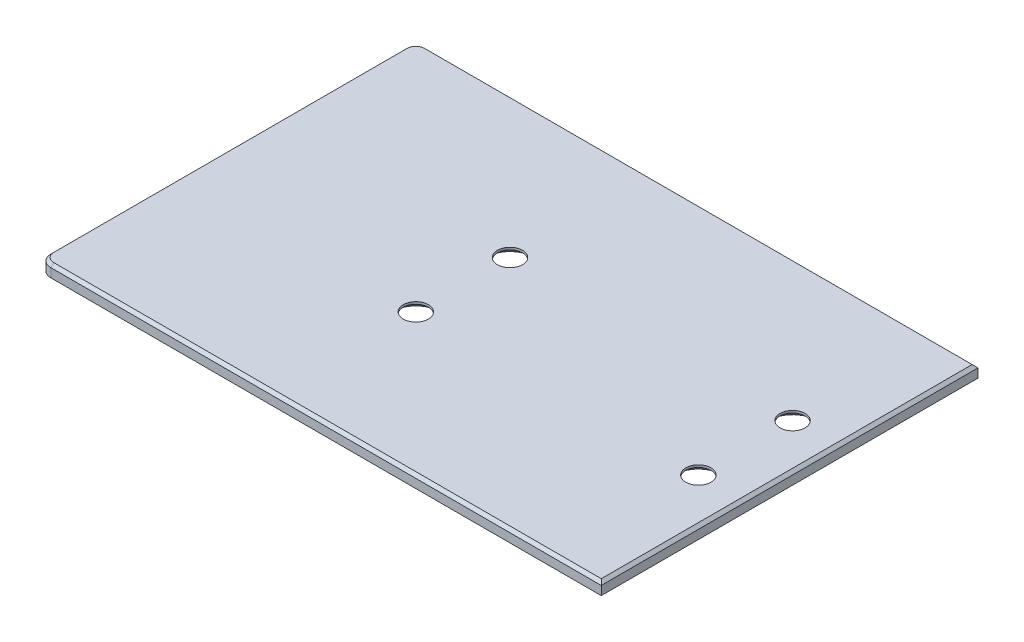
ISO-10303-21;
HEADER;
FILE_DESCRIPTION(('STEP AP214'),'2;1');
FILE_NAME('part.step','',(''),(''),'','','');
FILE_SCHEMA(('AUTOMOTIVE_DESIGN { 1 0 10303 214 1 1 1 1 }'));
ENDSEC;
DATA;
#1=APPLICATION_CONTEXT('core data for automotive mechanical design processes');
#2=APPLICATION_PROTOCOL_DEFINITION('international standard','automotive_design',2000,#1);
#3=PRODUCT_CONTEXT('',#1,'mechanical');
#4=PRODUCT('Part','Part','',(#3));
#5=PRODUCT_RELATED_PRODUCT_CATEGORY('part','',(#4));
#6=PRODUCT_DEFINITION_FORMATION('','',#4);
#7=PRODUCT_DEFINITION_CONTEXT('part definition',#1,'design');
#8=PRODUCT_DEFINITION('design','',#6,#7);
#9=PRODUCT_DEFINITION_SHAPE('','',#8);
#10=(LENGTH_UNIT() NAMED_UNIT(*) SI_UNIT(.MILLI.,.METRE.));
#11=(NAMED_UNIT(*) PLANE_ANGLE_UNIT() SI_UNIT($,.RADIAN.));
#12=(NAMED_UNIT(*) SI_UNIT($,.STERADIAN.) SOLID_ANGLE_UNIT());
#13=UNCERTAINTY_MEASURE_WITH_UNIT(LENGTH_MEASURE(1.E-05),#10,'distance_accuracy_value','');
#14=(GEOMETRIC_REPRESENTATION_CONTEXT(3) GLOBAL_UNCERTAINTY_ASSIGNED_CONTEXT((#13)) GLOBAL_UNIT_ASSIGNED_CONTEXT((#10,
#11,#12)) REPRESENTATION_CONTEXT('',''));
#15=CARTESIAN_POINT('',(0.,0.,0.));
#16=DIRECTION('',(0.,0.,1.));
#17=DIRECTION('',(1.,0.,0.));
#18=AXIS2_PLACEMENT_3D('',#15,#16,#17);
#19=CARTESIAN_POINT('',(0.,0.,-101.6));
#20=DIRECTION('',(-1.,0.,0.));
#21=DIRECTION('',(0.,0.,1.));
#22=AXIS2_PLACEMENT_3D('',#19,#20,#21);
#23=PLANE('',#22);
#24=DIRECTION('',(0.,-1.,0.));
#25=VECTOR('',#24,1.);
#26=CARTESIAN_POINT('',(0.,0.,-3.175));
#27=LINE('',#26,#25);
#28=CARTESIAN_POINT('',(0.,-0.787399999999994,-3.175));
#29=VERTEX_POINT('',#28);
#30=CARTESIAN_POINT('',(0.,-3.175,-3.175));
#31=VERTEX_POINT('',#30);
#32=EDGE_CURVE('E117',#29,#31,#27,.T.);
#33=ORIENTED_EDGE('',*,*,#32,.F.);
#34=DIRECTION('',(0.,0.,-1.));
#35=VECTOR('',#34,1.);
#36=CARTESIAN_POINT('',(0.,-0.787399999999994,-101.6));
#37=LINE('',#36,#35);
#38=CARTESIAN_POINT('',(0.,-0.787399999999994,-98.425));
#39=VERTEX_POINT('',#38);
#40=EDGE_CURVE('E164',#29,#39,#37,.T.);
#41=ORIENTED_EDGE('',*,*,#40,.T.);
#42=DIRECTION('',(0.,-1.,0.));
#43=VECTOR('',#42,1.);
#44=CARTESIAN_POINT('',(0.,0.,-98.425));
#45=LINE('',#44,#43);
#46=CARTESIAN_POINT('',(0.,-3.175,-98.425));
#47=VERTEX_POINT('',#46);
#48=EDGE_CURVE('E139',#39,#47,#45,.T.);
#49=ORIENTED_EDGE('',*,*,#48,.T.);
#50=DIRECTION('',(0.,0.,1.));
#51=VECTOR('',#50,1.);
#52=CARTESIAN_POINT('',(0.,-3.175,-101.6));
#53=LINE('',#52,#51);
#54=EDGE_CURVE('E136',#47,#31,#53,.T.);
#55=ORIENTED_EDGE('',*,*,#54,.T.);
#56=EDGE_LOOP('',(#33,#41,#49,#55));
#57=FACE_BOUND('',#56,.T.);
#58=ADVANCED_FACE('F42',(#57),#23,.T.);
#59=CARTESIAN_POINT('',(0.,0.,-101.6));
#60=DIRECTION('',(0.,1.,0.));
#61=DIRECTION('',(0.,0.,1.));
#62=AXIS2_PLACEMENT_3D('',#59,#60,#61);
#63=PLANE('',#62);
#64=CARTESIAN_POINT('',(3.175,0.,-98.425));
#65=DIRECTION('',(0.,1.,0.));
#66=DIRECTION('',(0.,0.,1.));
#67=AXIS2_PLACEMENT_3D('',#64,#65,#66);
#68=CIRCLE('',#67,2.3876);
#69=CARTESIAN_POINT('',(3.175,0.,-100.8126));
#70=VERTEX_POINT('',#69);
#71=CARTESIAN_POINT('',(0.787399999999995,0.,-98.425));
#72=VERTEX_POINT('',#71);
#73=EDGE_CURVE('E159',#70,#72,#68,.T.);
#74=ORIENTED_EDGE('',*,*,#73,.T.);
#75=DIRECTION('',(0.,0.,1.));
#76=VECTOR('',#75,1.);
#77=CARTESIAN_POINT('',(0.787399999999994,0.,-101.6));
#78=LINE('',#77,#76);
#79=CARTESIAN_POINT('',(0.787399999999994,0.,-3.175));
#80=VERTEX_POINT('',#79);
#81=EDGE_CURVE('E161',#72,#80,#78,.T.);
#82=ORIENTED_EDGE('',*,*,#81,.T.);
#83=CARTESIAN_POINT('',(3.175,0.,-3.175));
#84=DIRECTION('',(0.,1.,0.));
#85=DIRECTION('',(0.,0.,1.));
#86=AXIS2_PLACEMENT_3D('',#83,#84,#85);
#87=CIRCLE('',#86,2.38760000000001);
#88=CARTESIAN_POINT('',(3.175,0.,-0.787399999999994));
#89=VERTEX_POINT('',#88);
#90=EDGE_CURVE('E157',#80,#89,#87,.T.);
#91=ORIENTED_EDGE('',*,*,#90,.T.);
#92=DIRECTION('',(1.,0.,0.));
#93=VECTOR('',#92,1.);
#94=CARTESIAN_POINT('',(0.,0.,-0.787399999999994));
#95=LINE('',#94,#93);
#96=CARTESIAN_POINT('',(150.81885,0.,-0.787399999999994));
#97=VERTEX_POINT('',#96);
#98=EDGE_CURVE('E146',#89,#97,#95,.T.);
#99=ORIENTED_EDGE('',*,*,#98,.T.);
#100=DIRECTION('',(0.,0.,-1.));
#101=VECTOR('',#100,1.);
#102=CARTESIAN_POINT('',(150.81885,0.,-101.6));
#103=LINE('',#102,#101);
#104=CARTESIAN_POINT('',(150.81885,0.,-100.8126));
#105=VERTEX_POINT('',#104);
#106=EDGE_CURVE('E153',#97,#105,#103,.T.);
#107=ORIENTED_EDGE('',*,*,#106,.T.);
#108=DIRECTION('',(-1.,0.,0.));
#109=VECTOR('',#108,1.);
#110=CARTESIAN_POINT('',(3.175,0.,-100.8126));
#111=LINE('',#110,#109);
#112=EDGE_CURVE('E155',#105,#70,#111,.T.);
#113=ORIENTED_EDGE('',*,*,#112,.T.);
#114=EDGE_LOOP('',(#74,#82,#91,#99,#107,#113));
#115=FACE_BOUND('',#114,.T.);
#116=CARTESIAN_POINT('',(63.5,0.,-38.1));
#117=DIRECTION('',(0.,-1.,0.));
#118=DIRECTION('',(0.,0.,-1.));
#119=AXIS2_PLACEMENT_3D('',#116,#117,#118);
#120=CIRCLE('',#119,3.3782);
#121=CARTESIAN_POINT('',(63.5,0.,-41.4782));
#122=VERTEX_POINT('',#121);
#123=EDGE_CURVE('E203',#122,#122,#120,.T.);
#124=ORIENTED_EDGE('',*,*,#123,.T.);
#125=EDGE_LOOP('',(#124));
#126=FACE_BOUND('',#125,.T.);
#127=CARTESIAN_POINT('',(63.5,0.,-63.5));
#128=DIRECTION('',(0.,-1.,0.));
#129=DIRECTION('',(0.,0.,-1.));
#130=AXIS2_PLACEMENT_3D('',#127,#128,#129);
#131=CIRCLE('',#130,3.3782);
#132=CARTESIAN_POINT('',(63.5,0.,-66.8782));
#133=VERTEX_POINT('',#132);
#134=EDGE_CURVE('E212',#133,#133,#131,.T.);
#135=ORIENTED_EDGE('',*,*,#134,.T.);
#136=EDGE_LOOP('',(#135));
#137=FACE_BOUND('',#136,.T.);
#138=CARTESIAN_POINT('',(139.7,0.,-63.5));
#139=DIRECTION('',(0.,-1.,0.));
#140=DIRECTION('',(0.,0.,-1.));
#141=AXIS2_PLACEMENT_3D('',#138,#139,#140);
#142=CIRCLE('',#141,3.3782);
#143=CARTESIAN_POINT('',(139.7,0.,-66.8782));
#144=VERTEX_POINT('',#143);
#145=EDGE_CURVE('E221',#144,#144,#142,.T.);
#146=ORIENTED_EDGE('',*,*,#145,.T.);
#147=EDGE_LOOP('',(#146));
#148=FACE_BOUND('',#147,.T.);
#149=CARTESIAN_POINT('',(139.7,0.,-38.1));
#150=DIRECTION('',(0.,-1.,0.));
#151=DIRECTION('',(0.,0.,-1.));
#152=AXIS2_PLACEMENT_3D('',#149,#150,#151);
#153=CIRCLE('',#152,3.3782);
#154=CARTESIAN_POINT('',(139.7,0.,-41.4782));
#155=VERTEX_POINT('',#154);
#156=EDGE_CURVE('E230',#155,#155,#153,.T.);
#157=ORIENTED_EDGE('',*,*,#156,.T.);
#158=EDGE_LOOP('',(#157));
#159=FACE_BOUND('',#158,.T.);
#160=ADVANCED_FACE('F260',(#115,#126,#137,#148,#159),#63,.T.);
#161=CARTESIAN_POINT('',(0.,-3.175,-101.6));
#162=DIRECTION('',(0.,-1.,0.));
#163=DIRECTION('',(0.,0.,-1.));
#164=AXIS2_PLACEMENT_3D('',#161,#162,#163);
#165=PLANE('',#164);
#166=CARTESIAN_POINT('',(63.5,-3.175,-38.1));
#167=DIRECTION('',(0.,-1.,0.));
#168=DIRECTION('',(0.,0.,-1.));
#169=AXIS2_PLACEMENT_3D('',#166,#167,#168);
#170=CIRCLE('',#169,6.4389);
#171=CARTESIAN_POINT('',(63.5,-3.175,-44.5389));
#172=VERTEX_POINT('',#171);
#173=EDGE_CURVE('E129',#172,#172,#170,.T.);
#174=ORIENTED_EDGE('',*,*,#173,.F.);
#175=EDGE_LOOP('',(#174));
#176=FACE_BOUND('',#175,.T.);
#177=CARTESIAN_POINT('',(63.5,-3.175,-63.5));
#178=DIRECTION('',(0.,-1.,0.));
#179=DIRECTION('',(0.,0.,-1.));
#180=AXIS2_PLACEMENT_3D('',#177,#178,#179);
#181=CIRCLE('',#180,6.4389);
#182=CARTESIAN_POINT('',(63.5,-3.175,-69.9389));
#183=VERTEX_POINT('',#182);
#184=EDGE_CURVE('E206',#183,#183,#181,.T.);
#185=ORIENTED_EDGE('',*,*,#184,.F.);
#186=EDGE_LOOP('',(#185));
#187=FACE_BOUND('',#186,.T.);
#188=CARTESIAN_POINT('',(139.7,-3.175,-63.5));
#189=DIRECTION('',(0.,-1.,0.));
#190=DIRECTION('',(0.,0.,-1.));
#191=AXIS2_PLACEMENT_3D('',#188,#189,#190);
#192=CIRCLE('',#191,6.4389);
#193=CARTESIAN_POINT('',(139.7,-3.175,-69.9389));
#194=VERTEX_POINT('',#193);
#195=EDGE_CURVE('E215',#194,#194,#192,.T.);
#196=ORIENTED_EDGE('',*,*,#195,.F.);
#197=EDGE_LOOP('',(#196));
#198=FACE_BOUND('',#197,.T.);
#199=CARTESIAN_POINT('',(139.7,-3.175,-38.1));
#200=DIRECTION('',(0.,-1.,0.));
#201=DIRECTION('',(0.,0.,-1.));
#202=AXIS2_PLACEMENT_3D('',#199,#200,#201);
#203=CIRCLE('',#202,6.4389);
#204=CARTESIAN_POINT('',(139.7,-3.175,-44.5389));
#205=VERTEX_POINT('',#204);
#206=EDGE_CURVE('E224',#205,#205,#203,.T.);
#207=ORIENTED_EDGE('',*,*,#206,.F.);
#208=EDGE_LOOP('',(#207));
#209=FACE_BOUND('',#208,.T.);
#210=CARTESIAN_POINT('',(3.175,-3.175,-3.175));
#211=DIRECTION('',(0.,1.,0.));
#212=DIRECTION('',(0.,0.,1.));
#213=AXIS2_PLACEMENT_3D('',#210,#211,#212);
#214=CIRCLE('',#213,3.175);
#215=CARTESIAN_POINT('',(3.175,-3.175,0.));
#216=VERTEX_POINT('',#215);
#217=EDGE_CURVE('E121',#31,#216,#214,.T.);
#218=ORIENTED_EDGE('',*,*,#217,.F.);
#219=ORIENTED_EDGE('',*,*,#54,.F.);
#220=CARTESIAN_POINT('',(3.175,-3.175,-98.425));
#221=DIRECTION('',(0.,1.,0.));
#222=DIRECTION('',(0.,0.,-1.));
#223=AXIS2_PLACEMENT_3D('',#220,#221,#222);
#224=CIRCLE('',#223,3.175);
#225=CARTESIAN_POINT('',(3.175,-3.175,-101.6));
#226=VERTEX_POINT('',#225);
#227=EDGE_CURVE('E187',#226,#47,#224,.T.);
#228=ORIENTED_EDGE('',*,*,#227,.F.);
#229=DIRECTION('',(1.,0.,0.));
#230=VECTOR('',#229,1.);
#231=CARTESIAN_POINT('',(0.,-3.175,-101.6));
#232=LINE('',#231,#230);
#233=CARTESIAN_POINT('',(151.60625,-3.175,-101.6));
#234=VERTEX_POINT('',#233);
#235=EDGE_CURVE('E148',#226,#234,#232,.T.);
#236=ORIENTED_EDGE('',*,*,#235,.T.);
#237=DIRECTION('',(0.,0.,1.));
#238=VECTOR('',#237,1.);
#239=CARTESIAN_POINT('',(151.60625,-3.175,-101.6));
#240=LINE('',#239,#238);
#241=CARTESIAN_POINT('',(151.60625,-3.175,0.));
#242=VERTEX_POINT('',#241);
#243=EDGE_CURVE('E143',#234,#242,#240,.T.);
#244=ORIENTED_EDGE('',*,*,#243,.T.);
#245=DIRECTION('',(1.,0.,0.));
#246=VECTOR('',#245,1.);
#247=CARTESIAN_POINT('',(0.,-3.175,0.));
#248=LINE('',#247,#246);
#249=EDGE_CURVE('E138',#216,#242,#248,.T.);
#250=ORIENTED_EDGE('',*,*,#249,.F.);
#251=EDGE_LOOP('',(#218,#219,#228,#236,#244,#250));
#252=FACE_BOUND('',#251,.T.);
#253=ADVANCED_FACE('F134',(#176,#187,#198,#209,#252),#165,.T.);
#254=CARTESIAN_POINT('',(151.60625,0.,-101.6));
#255=DIRECTION('',(1.,0.,0.));
#256=DIRECTION('',(0.,0.,-1.));
#257=AXIS2_PLACEMENT_3D('',#254,#255,#256);
#258=PLANE('',#257);
#259=DIRECTION('',(0.,1.,0.));
#260=VECTOR('',#259,1.);
#261=CARTESIAN_POINT('',(151.60625,0.,-101.6));
#262=LINE('',#261,#260);
#263=CARTESIAN_POINT('',(151.60625,-0.787399999999994,-101.6));
#264=VERTEX_POINT('',#263);
#265=EDGE_CURVE('E144',#234,#264,#262,.T.);
#266=ORIENTED_EDGE('',*,*,#265,.T.);
#267=DIRECTION('',(0.,0.,1.));
#268=VECTOR('',#267,1.);
#269=CARTESIAN_POINT('',(151.60625,-0.787399999999994,-101.6));
#270=LINE('',#269,#268);
#271=CARTESIAN_POINT('',(151.60625,-0.787399999999994,0.));
#272=VERTEX_POINT('',#271);
#273=EDGE_CURVE('E52',#264,#272,#270,.T.);
#274=ORIENTED_EDGE('',*,*,#273,.T.);
#275=DIRECTION('',(0.,1.,0.));
#276=VECTOR('',#275,1.);
#277=CARTESIAN_POINT('',(151.60625,0.,0.));
#278=LINE('',#277,#276);
#279=EDGE_CURVE('E233',#242,#272,#278,.T.);
#280=ORIENTED_EDGE('',*,*,#279,.F.);
#281=ORIENTED_EDGE('',*,*,#243,.F.);
#282=EDGE_LOOP('',(#266,#274,#280,#281));
#283=FACE_BOUND('',#282,.T.);
#284=ADVANCED_FACE('F286',(#283),#258,.T.);
#285=CARTESIAN_POINT('',(0.,0.,-101.6));
#286=DIRECTION('',(0.,0.,1.));
#287=DIRECTION('',(1.,0.,0.));
#288=AXIS2_PLACEMENT_3D('',#285,#286,#287);
#289=PLANE('',#288);
#290=DIRECTION('',(0.,-1.,0.));
#291=VECTOR('',#290,1.);
#292=CARTESIAN_POINT('',(3.175,0.,-101.6));
#293=LINE('',#292,#291);
#294=CARTESIAN_POINT('',(3.175,-0.787399999999994,-101.6));
#295=VERTEX_POINT('',#294);
#296=EDGE_CURVE('E191',#295,#226,#293,.T.);
#297=ORIENTED_EDGE('',*,*,#296,.F.);
#298=DIRECTION('',(1.,0.,0.));
#299=VECTOR('',#298,1.);
#300=CARTESIAN_POINT('',(151.60625,-0.787399999999994,-101.6));
#301=LINE('',#300,#299);
#302=EDGE_CURVE('E67',#295,#264,#301,.T.);
#303=ORIENTED_EDGE('',*,*,#302,.T.);
#304=ORIENTED_EDGE('',*,*,#265,.F.);
#305=ORIENTED_EDGE('',*,*,#235,.F.);
#306=EDGE_LOOP('',(#297,#303,#304,#305));
#307=FACE_BOUND('',#306,.T.);
#308=ADVANCED_FACE('F254',(#307),#289,.F.);
#309=CARTESIAN_POINT('',(0.,0.,0.));
#310=DIRECTION('',(0.,0.,1.));
#311=DIRECTION('',(1.,0.,0.));
#312=AXIS2_PLACEMENT_3D('',#309,#310,#311);
#313=PLANE('',#312);
#314=ORIENTED_EDGE('',*,*,#279,.T.);
#315=DIRECTION('',(-1.,0.,0.));
#316=VECTOR('',#315,1.);
#317=CARTESIAN_POINT('',(0.,-0.787399999999994,0.));
#318=LINE('',#317,#316);
#319=CARTESIAN_POINT('',(3.175,-0.787399999999994,0.));
#320=VERTEX_POINT('',#319);
#321=EDGE_CURVE('E11',#272,#320,#318,.T.);
#322=ORIENTED_EDGE('',*,*,#321,.T.);
#323=DIRECTION('',(0.,-1.,0.));
#324=VECTOR('',#323,1.);
#325=CARTESIAN_POINT('',(3.175,0.,0.));
#326=LINE('',#325,#324);
#327=EDGE_CURVE('E130',#320,#216,#326,.T.);
#328=ORIENTED_EDGE('',*,*,#327,.T.);
#329=ORIENTED_EDGE('',*,*,#249,.T.);
#330=EDGE_LOOP('',(#314,#322,#328,#329));
#331=FACE_BOUND('',#330,.T.);
#332=ADVANCED_FACE('F236',(#331),#313,.T.);
#333=CARTESIAN_POINT('',(139.7,-3.175,-38.1));
#334=DIRECTION('',(0.,-1.,0.));
#335=DIRECTION('',(0.,0.,-1.));
#336=AXIS2_PLACEMENT_3D('',#333,#334,#335);
#337=CYLINDRICAL_SURFACE('',#336,3.3782);
#338=ORIENTED_EDGE('',*,*,#156,.F.);
#339=EDGE_LOOP('',(#338));
#340=FACE_BOUND('',#339,.T.);
#341=CARTESIAN_POINT('',(139.7,-0.606767758855683,-38.1));
#342=DIRECTION('',(0.,-1.,0.));
#343=DIRECTION('',(0.,0.,-1.));
#344=AXIS2_PLACEMENT_3D('',#341,#342,#343);
#345=CIRCLE('',#344,3.3782);
#346=CARTESIAN_POINT('',(139.7,-0.606767758855683,-41.4782));
#347=VERTEX_POINT('',#346);
#348=EDGE_CURVE('E227',#347,#347,#345,.T.);
#349=ORIENTED_EDGE('',*,*,#348,.T.);
#350=EDGE_LOOP('',(#349));
#351=FACE_BOUND('',#350,.T.);
#352=ADVANCED_FACE('F272',(#340,#351),#337,.F.);
#353=CARTESIAN_POINT('',(139.7,-3.175,-38.1));
#354=DIRECTION('',(0.,-1.,0.));
#355=DIRECTION('',(0.,0.,-1.));
#356=AXIS2_PLACEMENT_3D('',#353,#354,#355);
#357=CONICAL_SURFACE('',#356,6.4389,0.872664625997162);
#358=ORIENTED_EDGE('',*,*,#348,.F.);
#359=EDGE_LOOP('',(#358));
#360=FACE_BOUND('',#359,.T.);
#361=ORIENTED_EDGE('',*,*,#206,.T.);
#362=EDGE_LOOP('',(#361));
#363=FACE_BOUND('',#362,.T.);
#364=ADVANCED_FACE('F275',(#360,#363),#357,.F.);
#365=CARTESIAN_POINT('',(139.7,-3.175,-63.5));
#366=DIRECTION('',(0.,-1.,0.));
#367=DIRECTION('',(0.,0.,-1.));
#368=AXIS2_PLACEMENT_3D('',#365,#366,#367);
#369=CYLINDRICAL_SURFACE('',#368,3.3782);
#370=ORIENTED_EDGE('',*,*,#145,.F.);
#371=EDGE_LOOP('',(#370));
#372=FACE_BOUND('',#371,.T.);
#373=CARTESIAN_POINT('',(139.7,-0.606767758855683,-63.5));
#374=DIRECTION('',(0.,-1.,0.));
#375=DIRECTION('',(0.,0.,-1.));
#376=AXIS2_PLACEMENT_3D('',#373,#374,#375);
#377=CIRCLE('',#376,3.3782);
#378=CARTESIAN_POINT('',(139.7,-0.606767758855683,-66.8782));
#379=VERTEX_POINT('',#378);
#380=EDGE_CURVE('E218',#379,#379,#377,.T.);
#381=ORIENTED_EDGE('',*,*,#380,.T.);
#382=EDGE_LOOP('',(#381));
#383=FACE_BOUND('',#382,.T.);
#384=ADVANCED_FACE('F281',(#372,#383),#369,.F.);
#385=CARTESIAN_POINT('',(139.7,-3.175,-63.5));
#386=DIRECTION('',(0.,-1.,0.));
#387=DIRECTION('',(0.,0.,-1.));
#388=AXIS2_PLACEMENT_3D('',#385,#386,#387);
#389=CONICAL_SURFACE('',#388,6.4389,0.872664625997162);
#390=ORIENTED_EDGE('',*,*,#380,.F.);
#391=EDGE_LOOP('',(#390));
#392=FACE_BOUND('',#391,.T.);
#393=ORIENTED_EDGE('',*,*,#195,.T.);
#394=EDGE_LOOP('',(#393));
#395=FACE_BOUND('',#394,.T.);
#396=ADVANCED_FACE('F350',(#392,#395),#389,.F.);
#397=CARTESIAN_POINT('',(63.5,-3.175,-63.5));
#398=DIRECTION('',(0.,-1.,0.));
#399=DIRECTION('',(0.,0.,-1.));
#400=AXIS2_PLACEMENT_3D('',#397,#398,#399);
#401=CYLINDRICAL_SURFACE('',#400,3.37819999999999);
#402=ORIENTED_EDGE('',*,*,#134,.F.);
#403=EDGE_LOOP('',(#402));
#404=FACE_BOUND('',#403,.T.);
#405=CARTESIAN_POINT('',(63.5,-0.606767758855683,-63.5));
#406=DIRECTION('',(0.,-1.,0.));
#407=DIRECTION('',(0.,0.,-1.));
#408=AXIS2_PLACEMENT_3D('',#405,#406,#407);
#409=CIRCLE('',#408,3.37819999999998);
#410=CARTESIAN_POINT('',(63.5,-0.606767758855683,-66.8782));
#411=VERTEX_POINT('',#410);
#412=EDGE_CURVE('E209',#411,#411,#409,.T.);
#413=ORIENTED_EDGE('',*,*,#412,.T.);
#414=EDGE_LOOP('',(#413));
#415=FACE_BOUND('',#414,.T.);
#416=ADVANCED_FACE('F346',(#404,#415),#401,.F.);
#417=CARTESIAN_POINT('',(63.5,-3.175,-63.5));
#418=DIRECTION('',(0.,-1.,0.));
#419=DIRECTION('',(0.,0.,-1.));
#420=AXIS2_PLACEMENT_3D('',#417,#418,#419);
#421=CONICAL_SURFACE('',#420,6.4389,0.872664625997164);
#422=ORIENTED_EDGE('',*,*,#412,.F.);
#423=EDGE_LOOP('',(#422));
#424=FACE_BOUND('',#423,.T.);
#425=ORIENTED_EDGE('',*,*,#184,.T.);
#426=EDGE_LOOP('',(#425));
#427=FACE_BOUND('',#426,.T.);
#428=ADVANCED_FACE('F342',(#424,#427),#421,.F.);
#429=CARTESIAN_POINT('',(63.5,-3.175,-38.1));
#430=DIRECTION('',(0.,-1.,0.));
#431=DIRECTION('',(0.,0.,-1.));
#432=AXIS2_PLACEMENT_3D('',#429,#430,#431);
#433=CYLINDRICAL_SURFACE('',#432,3.37819999999999);
#434=ORIENTED_EDGE('',*,*,#123,.F.);
#435=EDGE_LOOP('',(#434));
#436=FACE_BOUND('',#435,.T.);
#437=CARTESIAN_POINT('',(63.5,-0.606767758855683,-38.1));
#438=DIRECTION('',(0.,-1.,0.));
#439=DIRECTION('',(0.,0.,-1.));
#440=AXIS2_PLACEMENT_3D('',#437,#438,#439);
#441=CIRCLE('',#440,3.37819999999998);
#442=CARTESIAN_POINT('',(63.5,-0.606767758855683,-41.4782));
#443=VERTEX_POINT('',#442);
#444=EDGE_CURVE('E200',#443,#443,#441,.T.);
#445=ORIENTED_EDGE('',*,*,#444,.T.);
#446=EDGE_LOOP('',(#445));
#447=FACE_BOUND('',#446,.T.);
#448=ADVANCED_FACE('F338',(#436,#447),#433,.F.);
#449=CARTESIAN_POINT('',(63.5,-3.175,-38.1));
#450=DIRECTION('',(0.,-1.,0.));
#451=DIRECTION('',(0.,0.,-1.));
#452=AXIS2_PLACEMENT_3D('',#449,#450,#451);
#453=CONICAL_SURFACE('',#452,6.4389,0.872664625997164);
#454=ORIENTED_EDGE('',*,*,#444,.F.);
#455=EDGE_LOOP('',(#454));
#456=FACE_BOUND('',#455,.T.);
#457=ORIENTED_EDGE('',*,*,#173,.T.);
#458=EDGE_LOOP('',(#457));
#459=FACE_BOUND('',#458,.T.);
#460=ADVANCED_FACE('F333',(#456,#459),#453,.F.);
#461=CARTESIAN_POINT('',(3.175,0.,-3.175));
#462=DIRECTION('',(0.,-1.,0.));
#463=DIRECTION('',(0.,0.,-1.));
#464=AXIS2_PLACEMENT_3D('',#461,#462,#463);
#465=CYLINDRICAL_SURFACE('',#464,3.175);
#466=ORIENTED_EDGE('',*,*,#327,.F.);
#467=CARTESIAN_POINT('',(3.175,-0.787399999999994,-3.175));
#468=DIRECTION('',(0.,1.,0.));
#469=DIRECTION('',(0.,0.,1.));
#470=AXIS2_PLACEMENT_3D('',#467,#468,#469);
#471=CIRCLE('',#470,3.175);
#472=EDGE_CURVE('E124',#320,#29,#471,.F.);
#473=ORIENTED_EDGE('',*,*,#472,.T.);
#474=ORIENTED_EDGE('',*,*,#32,.T.);
#475=ORIENTED_EDGE('',*,*,#217,.T.);
#476=EDGE_LOOP('',(#466,#473,#474,#475));
#477=FACE_BOUND('',#476,.T.);
#478=ADVANCED_FACE('F120',(#477),#465,.T.);
#479=CARTESIAN_POINT('',(3.175,0.,-98.425));
#480=DIRECTION('',(0.,-1.,0.));
#481=DIRECTION('',(0.,0.,-1.));
#482=AXIS2_PLACEMENT_3D('',#479,#480,#481);
#483=CYLINDRICAL_SURFACE('',#482,3.175);
#484=ORIENTED_EDGE('',*,*,#48,.F.);
#485=CARTESIAN_POINT('',(3.175,-0.787399999999994,-98.425));
#486=DIRECTION('',(0.,1.,0.));
#487=DIRECTION('',(0.,0.,1.));
#488=AXIS2_PLACEMENT_3D('',#485,#486,#487);
#489=CIRCLE('',#488,3.175);
#490=EDGE_CURVE('E166',#39,#295,#489,.F.);
#491=ORIENTED_EDGE('',*,*,#490,.T.);
#492=ORIENTED_EDGE('',*,*,#296,.T.);
#493=ORIENTED_EDGE('',*,*,#227,.T.);
#494=EDGE_LOOP('',(#484,#491,#492,#493));
#495=FACE_BOUND('',#494,.T.);
#496=ADVANCED_FACE('F251',(#495),#483,.T.);
#497=CARTESIAN_POINT('',(151.60625,-0.787399999999994,-101.6));
#498=DIRECTION('',(-0.707106781186547,-0.707106781186547,0.));
#499=DIRECTION('',(0.,0.,1.));
#500=AXIS2_PLACEMENT_3D('',#497,#498,#499);
#501=PLANE('',#500);
#502=DIRECTION('',(-0.577350269189626,0.577350269189626,-0.577350269189626));
#503=VECTOR('',#502,1.);
#504=CARTESIAN_POINT('',(101.070833333333,49.7480166666667,-50.5354166666667));
#505=LINE('',#504,#503);
#506=EDGE_CURVE('E180',#272,#97,#505,.T.);
#507=ORIENTED_EDGE('',*,*,#506,.F.);
#508=ORIENTED_EDGE('',*,*,#273,.F.);
#509=DIRECTION('',(0.577350269189626,-0.577350269189626,-0.577350269189626));
#510=VECTOR('',#509,1.);
#511=CARTESIAN_POINT('',(151.60625,-0.787399999999994,-101.6));
#512=LINE('',#511,#510);
#513=EDGE_CURVE('E47',#105,#264,#512,.T.);
#514=ORIENTED_EDGE('',*,*,#513,.F.);
#515=ORIENTED_EDGE('',*,*,#106,.F.);
#516=EDGE_LOOP('',(#507,#508,#514,#515));
#517=FACE_BOUND('',#516,.T.);
#518=ADVANCED_FACE('F45',(#517),#501,.F.);
#519=CARTESIAN_POINT('',(0.,0.,-100.8126));
#520=DIRECTION('',(0.,0.707106781186547,-0.707106781186547));
#521=DIRECTION('',(1.,0.,0.));
#522=AXIS2_PLACEMENT_3D('',#519,#520,#521);
#523=PLANE('',#522);
#524=ORIENTED_EDGE('',*,*,#513,.T.);
#525=ORIENTED_EDGE('',*,*,#302,.F.);
#526=DIRECTION('',(0.,-0.707106781186547,-0.707106781186547));
#527=VECTOR('',#526,1.);
#528=CARTESIAN_POINT('',(3.175,0.,-100.8126));
#529=LINE('',#528,#527);
#530=EDGE_CURVE('E178',#70,#295,#529,.T.);
#531=ORIENTED_EDGE('',*,*,#530,.F.);
#532=ORIENTED_EDGE('',*,*,#112,.F.);
#533=EDGE_LOOP('',(#524,#525,#531,#532));
#534=FACE_BOUND('',#533,.T.);
#535=ADVANCED_FACE('F256',(#534),#523,.T.);
#536=CARTESIAN_POINT('',(0.,-0.787399999999994,0.));
#537=DIRECTION('',(0.,-0.707106781186547,-0.707106781186547));
#538=DIRECTION('',(-1.,0.,0.));
#539=AXIS2_PLACEMENT_3D('',#536,#537,#538);
#540=PLANE('',#539);
#541=ORIENTED_EDGE('',*,*,#506,.T.);
#542=ORIENTED_EDGE('',*,*,#98,.F.);
#543=DIRECTION('',(0.,0.707106781186547,-0.707106781186547));
#544=VECTOR('',#543,1.);
#545=CARTESIAN_POINT('',(3.175,-0.787399999999994,0.));
#546=LINE('',#545,#544);
#547=EDGE_CURVE('E175',#320,#89,#546,.T.);
#548=ORIENTED_EDGE('',*,*,#547,.F.);
#549=ORIENTED_EDGE('',*,*,#321,.F.);
#550=EDGE_LOOP('',(#541,#542,#548,#549));
#551=FACE_BOUND('',#550,.T.);
#552=ADVANCED_FACE('F241',(#551),#540,.F.);
#553=CARTESIAN_POINT('',(3.175,0.,-98.425));
#554=DIRECTION('',(0.,-1.,0.));
#555=DIRECTION('',(0.,0.,-1.));
#556=AXIS2_PLACEMENT_3D('',#553,#554,#555);
#557=CONICAL_SURFACE('',#556,2.3876,0.785398163397448);
#558=ORIENTED_EDGE('',*,*,#530,.T.);
#559=ORIENTED_EDGE('',*,*,#490,.F.);
#560=DIRECTION('',(-0.707106781186547,-0.707106781186548,0.));
#561=VECTOR('',#560,1.);
#562=CARTESIAN_POINT('',(0.787399999999995,0.,-98.425));
#563=LINE('',#562,#561);
#564=EDGE_CURVE('E173',#72,#39,#563,.T.);
#565=ORIENTED_EDGE('',*,*,#564,.F.);
#566=ORIENTED_EDGE('',*,*,#73,.F.);
#567=EDGE_LOOP('',(#558,#559,#565,#566));
#568=FACE_BOUND('',#567,.T.);
#569=ADVANCED_FACE('F258',(#568),#557,.T.);
#570=CARTESIAN_POINT('',(3.175,0.,-3.175));
#571=DIRECTION('',(0.,-1.,0.));
#572=DIRECTION('',(0.,0.,-1.));
#573=AXIS2_PLACEMENT_3D('',#570,#571,#572);
#574=CONICAL_SURFACE('',#573,2.38760000000001,0.785398163397448);
#575=ORIENTED_EDGE('',*,*,#547,.T.);
#576=ORIENTED_EDGE('',*,*,#90,.F.);
#577=DIRECTION('',(0.707106781186547,0.707106781186547,0.));
#578=VECTOR('',#577,1.);
#579=CARTESIAN_POINT('',(0.,-0.787399999999994,-3.175));
#580=LINE('',#579,#578);
#581=EDGE_CURVE('E171',#29,#80,#580,.T.);
#582=ORIENTED_EDGE('',*,*,#581,.F.);
#583=ORIENTED_EDGE('',*,*,#472,.F.);
#584=EDGE_LOOP('',(#575,#576,#582,#583));
#585=FACE_BOUND('',#584,.T.);
#586=ADVANCED_FACE('F245',(#585),#574,.T.);
#587=CARTESIAN_POINT('',(0.787399999999994,0.,-101.6));
#588=DIRECTION('',(0.707106781186547,-0.707106781186547,0.));
#589=DIRECTION('',(0.,0.,1.));
#590=AXIS2_PLACEMENT_3D('',#587,#588,#589);
#591=PLANE('',#590);
#592=ORIENTED_EDGE('',*,*,#564,.T.);
#593=ORIENTED_EDGE('',*,*,#40,.F.);
#594=ORIENTED_EDGE('',*,*,#581,.T.);
#595=ORIENTED_EDGE('',*,*,#81,.F.);
#596=EDGE_LOOP('',(#592,#593,#594,#595));
#597=FACE_BOUND('',#596,.T.);
#598=ADVANCED_FACE('F248',(#597),#591,.F.);
#599=CLOSED_SHELL('',(#58,#160,#253,#284,#308,#332,#352,#364,#384,#396,#416,#428,#448,#460,#478,
#496,#518,#535,#552,#569,#586,#598));
#600=MANIFOLD_SOLID_BREP('B2',#599);
#601=ADVANCED_BREP_SHAPE_REPRESENTATION('',(#18,#600),#14);
#602=SHAPE_DEFINITION_REPRESENTATION(#9,#601);
ENDSEC;
END-ISO-10303-21;
